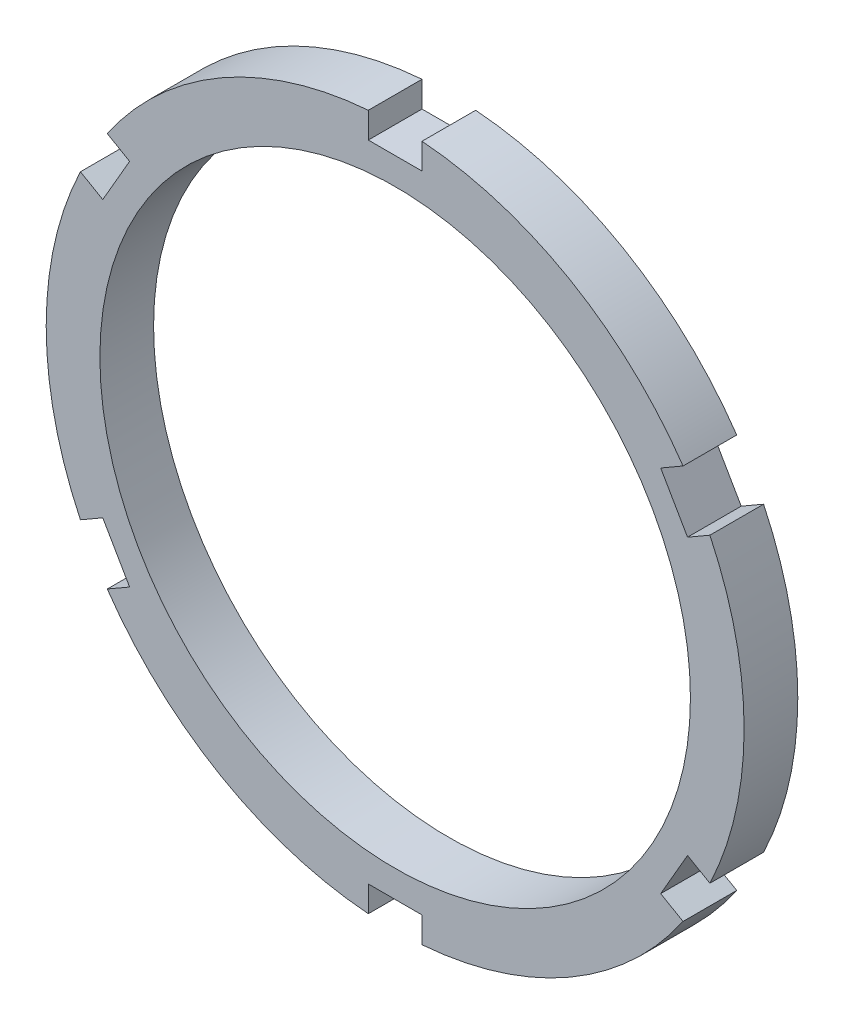
ISO-10303-21;
HEADER;
FILE_DESCRIPTION(('STEP AP214'),'2;1');
FILE_NAME('part.step','',(''),(''),'','','');
FILE_SCHEMA(('AUTOMOTIVE_DESIGN { 1 0 10303 214 1 1 1 1 }'));
ENDSEC;
DATA;
#1=APPLICATION_CONTEXT('core data for automotive mechanical design processes');
#2=APPLICATION_PROTOCOL_DEFINITION('international standard','automotive_design',2000,#1);
#3=PRODUCT_CONTEXT('',#1,'mechanical');
#4=PRODUCT('Part','Part','',(#3));
#5=PRODUCT_RELATED_PRODUCT_CATEGORY('part','',(#4));
#6=PRODUCT_DEFINITION_FORMATION('','',#4);
#7=PRODUCT_DEFINITION_CONTEXT('part definition',#1,'design');
#8=PRODUCT_DEFINITION('design','',#6,#7);
#9=PRODUCT_DEFINITION_SHAPE('','',#8);
#10=(LENGTH_UNIT() NAMED_UNIT(*) SI_UNIT(.MILLI.,.METRE.));
#11=(NAMED_UNIT(*) PLANE_ANGLE_UNIT() SI_UNIT($,.RADIAN.));
#12=(NAMED_UNIT(*) SI_UNIT($,.STERADIAN.) SOLID_ANGLE_UNIT());
#13=UNCERTAINTY_MEASURE_WITH_UNIT(LENGTH_MEASURE(1.E-05),#10,'distance_accuracy_value','');
#14=(GEOMETRIC_REPRESENTATION_CONTEXT(3) GLOBAL_UNCERTAINTY_ASSIGNED_CONTEXT((#13)) GLOBAL_UNIT_ASSIGNED_CONTEXT((#10,
#11,#12)) REPRESENTATION_CONTEXT('',''));
#15=CARTESIAN_POINT('',(0.,0.,0.));
#16=DIRECTION('',(0.,0.,1.));
#17=DIRECTION('',(1.,0.,0.));
#18=AXIS2_PLACEMENT_3D('',#15,#16,#17);
#19=CARTESIAN_POINT('',(0.,0.,10.));
#20=DIRECTION('',(0.,0.,-1.));
#21=DIRECTION('',(-1.,0.,0.));
#22=AXIS2_PLACEMENT_3D('',#19,#20,#21);
#23=CYLINDRICAL_SURFACE('',#22,65.);
#24=CARTESIAN_POINT('',(0.,0.,10.));
#25=DIRECTION('',(0.,0.,1.));
#26=DIRECTION('',(1.,0.,0.));
#27=AXIS2_PLACEMENT_3D('',#24,#25,#26);
#28=CIRCLE('',#27,65.);
#29=CARTESIAN_POINT('',(-5.,64.8074069840786,10.));
#30=VERTEX_POINT('',#29);
#31=CARTESIAN_POINT('',(-53.6248608016112,36.7338305109585,10.));
#32=VERTEX_POINT('',#31);
#33=EDGE_CURVE('E306',#30,#32,#28,.T.);
#34=ORIENTED_EDGE('',*,*,#33,.F.);
#35=DIRECTION('',(0.,0.,-1.));
#36=VECTOR('',#35,1.);
#37=CARTESIAN_POINT('',(-5.,64.8074069840786,10.));
#38=LINE('',#37,#36);
#39=CARTESIAN_POINT('',(-5.,64.8074069840786,0.));
#40=VERTEX_POINT('',#39);
#41=EDGE_CURVE('E274',#30,#40,#38,.T.);
#42=ORIENTED_EDGE('',*,*,#41,.T.);
#43=CARTESIAN_POINT('',(0.,0.,0.));
#44=DIRECTION('',(0.,0.,1.));
#45=DIRECTION('',(1.,0.,0.));
#46=AXIS2_PLACEMENT_3D('',#43,#44,#45);
#47=CIRCLE('',#46,65.);
#48=CARTESIAN_POINT('',(-53.6248608016112,36.7338305109585,0.));
#49=VERTEX_POINT('',#48);
#50=EDGE_CURVE('E220',#40,#49,#47,.T.);
#51=ORIENTED_EDGE('',*,*,#50,.T.);
#52=DIRECTION('',(0.,0.,-1.));
#53=VECTOR('',#52,1.);
#54=CARTESIAN_POINT('',(-53.6248608016112,36.7338305109585,10.));
#55=LINE('',#54,#53);
#56=EDGE_CURVE('E271',#49,#32,#55,.F.);
#57=ORIENTED_EDGE('',*,*,#56,.T.);
#58=EDGE_LOOP('',(#34,#42,#51,#57));
#59=FACE_BOUND('',#58,.T.);
#60=ADVANCED_FACE('F37',(#59),#23,.T.);
#61=CARTESIAN_POINT('',(-58.6248608016107,28.0735764731139,10.));
#62=VERTEX_POINT('',#61);
#63=CARTESIAN_POINT('',(-58.6248608016042,-28.0735764731275,10.));
#64=VERTEX_POINT('',#63);
#65=EDGE_CURVE('E269',#62,#64,#28,.T.);
#66=ORIENTED_EDGE('',*,*,#65,.F.);
#67=DIRECTION('',(0.,0.,-1.));
#68=VECTOR('',#67,1.);
#69=CARTESIAN_POINT('',(-58.6248608016107,28.0735764731139,10.));
#70=LINE('',#69,#68);
#71=CARTESIAN_POINT('',(-58.6248608016107,28.0735764731139,0.));
#72=VERTEX_POINT('',#71);
#73=EDGE_CURVE('E260',#62,#72,#70,.T.);
#74=ORIENTED_EDGE('',*,*,#73,.T.);
#75=CARTESIAN_POINT('',(-58.6248608016042,-28.0735764731275,0.));
#76=VERTEX_POINT('',#75);
#77=EDGE_CURVE('E227',#72,#76,#47,.T.);
#78=ORIENTED_EDGE('',*,*,#77,.T.);
#79=DIRECTION('',(0.,0.,-1.));
#80=VECTOR('',#79,1.);
#81=CARTESIAN_POINT('',(-58.6248608016041,-28.0735764731275,10.));
#82=LINE('',#81,#80);
#83=EDGE_CURVE('E340',#76,#64,#82,.F.);
#84=ORIENTED_EDGE('',*,*,#83,.T.);
#85=EDGE_LOOP('',(#66,#74,#78,#84));
#86=FACE_BOUND('',#85,.T.);
#87=ADVANCED_FACE('F266',(#86),#23,.T.);
#88=CARTESIAN_POINT('',(-53.6248608016026,-36.733830510971,10.));
#89=VERTEX_POINT('',#88);
#90=CARTESIAN_POINT('',(-4.99999999998411,-64.8074069840798,10.));
#91=VERTEX_POINT('',#90);
#92=EDGE_CURVE('E309',#89,#91,#28,.T.);
#93=ORIENTED_EDGE('',*,*,#92,.F.);
#94=DIRECTION('',(0.,0.,-1.));
#95=VECTOR('',#94,1.);
#96=CARTESIAN_POINT('',(-53.6248608016026,-36.733830510971,10.));
#97=LINE('',#96,#95);
#98=CARTESIAN_POINT('',(-53.6248608016026,-36.733830510971,0.));
#99=VERTEX_POINT('',#98);
#100=EDGE_CURVE('E276',#89,#99,#97,.T.);
#101=ORIENTED_EDGE('',*,*,#100,.T.);
#102=CARTESIAN_POINT('',(-4.99999999998411,-64.8074069840798,0.));
#103=VERTEX_POINT('',#102);
#104=EDGE_CURVE('E233',#99,#103,#47,.T.);
#105=ORIENTED_EDGE('',*,*,#104,.T.);
#106=DIRECTION('',(0.,0.,-1.));
#107=VECTOR('',#106,1.);
#108=CARTESIAN_POINT('',(-4.99999999998411,-64.8074069840798,10.));
#109=LINE('',#108,#107);
#110=EDGE_CURVE('E426',#103,#91,#109,.F.);
#111=ORIENTED_EDGE('',*,*,#110,.T.);
#112=EDGE_LOOP('',(#93,#101,#105,#111));
#113=FACE_BOUND('',#112,.T.);
#114=ADVANCED_FACE('F303',(#113),#23,.T.);
#115=CARTESIAN_POINT('',(53.6248608016066,36.7338305109651,0.));
#116=VERTEX_POINT('',#115);
#117=CARTESIAN_POINT('',(5.,64.8074069840786,0.));
#118=VERTEX_POINT('',#117);
#119=EDGE_CURVE('E226',#116,#118,#47,.T.);
#120=ORIENTED_EDGE('',*,*,#119,.T.);
#121=DIRECTION('',(0.,0.,-1.));
#122=VECTOR('',#121,1.);
#123=CARTESIAN_POINT('',(5.,64.8074069840786,10.));
#124=LINE('',#123,#122);
#125=CARTESIAN_POINT('',(5.,64.8074069840786,10.));
#126=VERTEX_POINT('',#125);
#127=EDGE_CURVE('E270',#118,#126,#124,.F.);
#128=ORIENTED_EDGE('',*,*,#127,.T.);
#129=CARTESIAN_POINT('',(53.6248608016066,36.7338305109651,10.));
#130=VERTEX_POINT('',#129);
#131=EDGE_CURVE('E244',#130,#126,#28,.T.);
#132=ORIENTED_EDGE('',*,*,#131,.F.);
#133=DIRECTION('',(0.,0.,-1.));
#134=VECTOR('',#133,1.);
#135=CARTESIAN_POINT('',(53.6248608016066,36.7338305109651,10.));
#136=LINE('',#135,#134);
#137=EDGE_CURVE('E337',#130,#116,#136,.T.);
#138=ORIENTED_EDGE('',*,*,#137,.T.);
#139=EDGE_LOOP('',(#120,#128,#132,#138));
#140=FACE_BOUND('',#139,.T.);
#141=ADVANCED_FACE('F637',(#140),#23,.T.);
#142=CARTESIAN_POINT('',(58.6248608016145,-28.0735764731059,0.));
#143=VERTEX_POINT('',#142);
#144=CARTESIAN_POINT('',(58.6248608016072,28.0735764731211,0.));
#145=VERTEX_POINT('',#144);
#146=EDGE_CURVE('E231',#143,#145,#47,.T.);
#147=ORIENTED_EDGE('',*,*,#146,.T.);
#148=DIRECTION('',(0.,0.,-1.));
#149=VECTOR('',#148,1.);
#150=CARTESIAN_POINT('',(58.6248608016072,28.0735764731211,10.));
#151=LINE('',#150,#149);
#152=CARTESIAN_POINT('',(58.6248608016072,28.0735764731211,10.));
#153=VERTEX_POINT('',#152);
#154=EDGE_CURVE('E333',#145,#153,#151,.F.);
#155=ORIENTED_EDGE('',*,*,#154,.T.);
#156=CARTESIAN_POINT('',(58.6248608016145,-28.0735764731059,10.));
#157=VERTEX_POINT('',#156);
#158=EDGE_CURVE('E230',#157,#153,#28,.T.);
#159=ORIENTED_EDGE('',*,*,#158,.F.);
#160=DIRECTION('',(0.,0.,-1.));
#161=VECTOR('',#160,1.);
#162=CARTESIAN_POINT('',(58.6248608016145,-28.0735764731059,10.));
#163=LINE('',#162,#161);
#164=EDGE_CURVE('E331',#157,#143,#163,.T.);
#165=ORIENTED_EDGE('',*,*,#164,.T.);
#166=EDGE_LOOP('',(#147,#155,#159,#165));
#167=FACE_BOUND('',#166,.T.);
#168=ADVANCED_FACE('F296',(#167),#23,.T.);
#169=CARTESIAN_POINT('',(5.00000000001589,-64.8074069840774,0.));
#170=VERTEX_POINT('',#169);
#171=CARTESIAN_POINT('',(53.6248608016161,-36.7338305109513,0.));
#172=VERTEX_POINT('',#171);
#173=EDGE_CURVE('E237',#170,#172,#47,.T.);
#174=ORIENTED_EDGE('',*,*,#173,.T.);
#175=DIRECTION('',(0.,0.,-1.));
#176=VECTOR('',#175,1.);
#177=CARTESIAN_POINT('',(53.6248608016161,-36.7338305109513,10.));
#178=LINE('',#177,#176);
#179=CARTESIAN_POINT('',(53.6248608016161,-36.7338305109513,10.));
#180=VERTEX_POINT('',#179);
#181=EDGE_CURVE('E60',#172,#180,#178,.F.);
#182=ORIENTED_EDGE('',*,*,#181,.T.);
#183=CARTESIAN_POINT('',(5.00000000001589,-64.8074069840774,10.));
#184=VERTEX_POINT('',#183);
#185=EDGE_CURVE('E312',#184,#180,#28,.T.);
#186=ORIENTED_EDGE('',*,*,#185,.F.);
#187=DIRECTION('',(0.,0.,-1.));
#188=VECTOR('',#187,1.);
#189=CARTESIAN_POINT('',(5.00000000001589,-64.8074069840774,10.));
#190=LINE('',#189,#188);
#191=EDGE_CURVE('E359',#184,#170,#190,.T.);
#192=ORIENTED_EDGE('',*,*,#191,.T.);
#193=EDGE_LOOP('',(#174,#182,#186,#192));
#194=FACE_BOUND('',#193,.T.);
#195=ADVANCED_FACE('F39',(#194),#23,.T.);
#196=CARTESIAN_POINT('',(0.,0.,10.));
#197=DIRECTION('',(0.,0.,1.));
#198=DIRECTION('',(1.,0.,0.));
#199=AXIS2_PLACEMENT_3D('',#196,#197,#198);
#200=PLANE('',#199);
#201=DIRECTION('',(0.,-1.,0.));
#202=VECTOR('',#201,1.);
#203=CARTESIAN_POINT('',(-5.,60.,10.));
#204=LINE('',#203,#202);
#205=CARTESIAN_POINT('',(-5.,60.,10.));
#206=VERTEX_POINT('',#205);
#207=EDGE_CURVE('E203',#30,#206,#204,.T.);
#208=ORIENTED_EDGE('',*,*,#207,.F.);
#209=ORIENTED_EDGE('',*,*,#33,.T.);
#210=DIRECTION('',(-0.866025403784438,0.5,0.));
#211=VECTOR('',#210,1.);
#212=CARTESIAN_POINT('',(-49.4615242270619,34.3301270189155,10.));
#213=LINE('',#212,#211);
#214=CARTESIAN_POINT('',(-49.4615242270619,34.3301270189155,10.));
#215=VERTEX_POINT('',#214);
#216=EDGE_CURVE('E439',#215,#32,#213,.T.);
#217=ORIENTED_EDGE('',*,*,#216,.F.);
#218=DIRECTION('',(0.499999999999999,0.866025403784439,0.));
#219=VECTOR('',#218,1.);
#220=CARTESIAN_POINT('',(-54.4615242270619,25.6698729810711,10.));
#221=LINE('',#220,#219);
#222=CARTESIAN_POINT('',(-54.4615242270619,25.6698729810711,10.));
#223=VERTEX_POINT('',#222);
#224=EDGE_CURVE('E436',#223,#215,#221,.T.);
#225=ORIENTED_EDGE('',*,*,#224,.F.);
#226=DIRECTION('',(0.866025403784439,-0.5,0.));
#227=VECTOR('',#226,1.);
#228=CARTESIAN_POINT('',(-54.4615242270619,25.6698729810711,10.));
#229=LINE('',#228,#227);
#230=EDGE_CURVE('E433',#62,#223,#229,.T.);
#231=ORIENTED_EDGE('',*,*,#230,.F.);
#232=ORIENTED_EDGE('',*,*,#65,.T.);
#233=DIRECTION('',(-0.866025403784438,-0.500000000000001,0.));
#234=VECTOR('',#233,1.);
#235=CARTESIAN_POINT('',(-54.461524227054,-25.669872981084,10.));
#236=LINE('',#235,#234);
#237=CARTESIAN_POINT('',(-54.461524227054,-25.669872981084,10.));
#238=VERTEX_POINT('',#237);
#239=EDGE_CURVE('E404',#238,#64,#236,.T.);
#240=ORIENTED_EDGE('',*,*,#239,.F.);
#241=DIRECTION('',(-0.5,0.866025403784439,0.));
#242=VECTOR('',#241,1.);
#243=CARTESIAN_POINT('',(-49.461524227054,-34.3301270189283,10.));
#244=LINE('',#243,#242);
#245=CARTESIAN_POINT('',(-49.461524227054,-34.3301270189283,10.));
#246=VERTEX_POINT('',#245);
#247=EDGE_CURVE('E401',#246,#238,#244,.T.);
#248=ORIENTED_EDGE('',*,*,#247,.F.);
#249=DIRECTION('',(0.866025403784438,0.5,0.));
#250=VECTOR('',#249,1.);
#251=CARTESIAN_POINT('',(-49.461524227054,-34.3301270189283,10.));
#252=LINE('',#251,#250);
#253=EDGE_CURVE('E398',#89,#246,#252,.T.);
#254=ORIENTED_EDGE('',*,*,#253,.F.);
#255=ORIENTED_EDGE('',*,*,#92,.T.);
#256=DIRECTION('',(0.,-1.,0.));
#257=VECTOR('',#256,1.);
#258=CARTESIAN_POINT('',(-4.99999999998411,-59.999999999999,10.));
#259=LINE('',#258,#257);
#260=CARTESIAN_POINT('',(-4.99999999998411,-59.999999999999,10.));
#261=VERTEX_POINT('',#260);
#262=EDGE_CURVE('E389',#261,#91,#259,.T.);
#263=ORIENTED_EDGE('',*,*,#262,.F.);
#264=DIRECTION('',(-1.,0.,0.));
#265=VECTOR('',#264,1.);
#266=CARTESIAN_POINT('',(5.00000000001589,-59.999999999999,10.));
#267=LINE('',#266,#265);
#268=CARTESIAN_POINT('',(5.00000000001589,-59.999999999999,10.));
#269=VERTEX_POINT('',#268);
#270=EDGE_CURVE('E386',#269,#261,#267,.T.);
#271=ORIENTED_EDGE('',*,*,#270,.F.);
#272=DIRECTION('',(0.,1.,0.));
#273=VECTOR('',#272,1.);
#274=CARTESIAN_POINT('',(5.00000000001589,-59.999999999999,10.));
#275=LINE('',#274,#273);
#276=EDGE_CURVE('E383',#184,#269,#275,.T.);
#277=ORIENTED_EDGE('',*,*,#276,.F.);
#278=ORIENTED_EDGE('',*,*,#185,.T.);
#279=DIRECTION('',(0.866025403784438,-0.5,0.));
#280=VECTOR('',#279,1.);
#281=CARTESIAN_POINT('',(49.4615242270778,-34.3301270189146,10.));
#282=LINE('',#281,#280);
#283=CARTESIAN_POINT('',(49.4615242270778,-34.3301270189146,10.));
#284=VERTEX_POINT('',#283);
#285=EDGE_CURVE('E374',#284,#180,#282,.T.);
#286=ORIENTED_EDGE('',*,*,#285,.F.);
#287=DIRECTION('',(-0.5,-0.866025403784439,0.));
#288=VECTOR('',#287,1.);
#289=CARTESIAN_POINT('',(54.4615242270778,-25.6698729810702,10.));
#290=LINE('',#289,#288);
#291=CARTESIAN_POINT('',(54.4615242270778,-25.6698729810702,10.));
#292=VERTEX_POINT('',#291);
#293=EDGE_CURVE('E371',#292,#284,#290,.T.);
#294=ORIENTED_EDGE('',*,*,#293,.F.);
#295=DIRECTION('',(-0.866025403784439,0.5,0.));
#296=VECTOR('',#295,1.);
#297=CARTESIAN_POINT('',(54.4615242270778,-25.6698729810702,10.));
#298=LINE('',#297,#296);
#299=EDGE_CURVE('E327',#157,#292,#298,.T.);
#300=ORIENTED_EDGE('',*,*,#299,.F.);
#301=ORIENTED_EDGE('',*,*,#158,.T.);
#302=DIRECTION('',(0.866025403784439,0.5,0.));
#303=VECTOR('',#302,1.);
#304=CARTESIAN_POINT('',(54.4615242270699,25.6698729810849,10.));
#305=LINE('',#304,#303);
#306=CARTESIAN_POINT('',(54.4615242270699,25.6698729810849,10.));
#307=VERTEX_POINT('',#306);
#308=EDGE_CURVE('E325',#307,#153,#305,.T.);
#309=ORIENTED_EDGE('',*,*,#308,.F.);
#310=DIRECTION('',(0.5,-0.866025403784438,0.));
#311=VECTOR('',#310,1.);
#312=CARTESIAN_POINT('',(49.4615242270699,34.3301270189293,10.));
#313=LINE('',#312,#311);
#314=CARTESIAN_POINT('',(49.4615242270699,34.3301270189293,10.));
#315=VERTEX_POINT('',#314);
#316=EDGE_CURVE('E379',#315,#307,#313,.T.);
#317=ORIENTED_EDGE('',*,*,#316,.F.);
#318=DIRECTION('',(-0.866025403784439,-0.5,0.));
#319=VECTOR('',#318,1.);
#320=CARTESIAN_POINT('',(49.4615242270699,34.3301270189293,10.));
#321=LINE('',#320,#319);
#322=EDGE_CURVE('E416',#130,#315,#321,.T.);
#323=ORIENTED_EDGE('',*,*,#322,.F.);
#324=ORIENTED_EDGE('',*,*,#131,.T.);
#325=DIRECTION('',(0.,1.,0.));
#326=VECTOR('',#325,1.);
#327=CARTESIAN_POINT('',(5.,60.,10.));
#328=LINE('',#327,#326);
#329=CARTESIAN_POINT('',(5.,60.,10.));
#330=VERTEX_POINT('',#329);
#331=EDGE_CURVE('E213',#330,#126,#328,.T.);
#332=ORIENTED_EDGE('',*,*,#331,.F.);
#333=DIRECTION('',(1.,0.,0.));
#334=VECTOR('',#333,1.);
#335=CARTESIAN_POINT('',(-5.,60.,10.));
#336=LINE('',#335,#334);
#337=EDGE_CURVE('E675',#206,#330,#336,.T.);
#338=ORIENTED_EDGE('',*,*,#337,.F.);
#339=EDGE_LOOP('',(#208,#209,#217,#225,#231,#232,#240,#248,#254,#255,#263,#271,#277,#278,#286,
#294,#300,#301,#309,#317,#323,#324,#332,#338));
#340=FACE_BOUND('',#339,.T.);
#341=CARTESIAN_POINT('',(0.,0.,10.));
#342=DIRECTION('',(0.,0.,1.));
#343=DIRECTION('',(1.,0.,0.));
#344=AXIS2_PLACEMENT_3D('',#341,#342,#343);
#345=CIRCLE('',#344,55.);
#346=CARTESIAN_POINT('',(55.,0.,10.));
#347=VERTEX_POINT('',#346);
#348=EDGE_CURVE('E281',#347,#347,#345,.T.);
#349=ORIENTED_EDGE('',*,*,#348,.F.);
#350=EDGE_LOOP('',(#349));
#351=FACE_BOUND('',#350,.T.);
#352=ADVANCED_FACE('F288',(#340,#351),#200,.T.);
#353=CARTESIAN_POINT('',(0.,0.,0.));
#354=DIRECTION('',(0.,0.,1.));
#355=DIRECTION('',(1.,0.,0.));
#356=AXIS2_PLACEMENT_3D('',#353,#354,#355);
#357=PLANE('',#356);
#358=ORIENTED_EDGE('',*,*,#50,.F.);
#359=DIRECTION('',(0.,-1.,0.));
#360=VECTOR('',#359,1.);
#361=CARTESIAN_POINT('',(-5.,0.,0.));
#362=LINE('',#361,#360);
#363=CARTESIAN_POINT('',(-5.,60.,0.));
#364=VERTEX_POINT('',#363);
#365=EDGE_CURVE('E11',#40,#364,#362,.T.);
#366=ORIENTED_EDGE('',*,*,#365,.T.);
#367=DIRECTION('',(1.,0.,0.));
#368=VECTOR('',#367,1.);
#369=CARTESIAN_POINT('',(-5.,60.,0.));
#370=LINE('',#369,#368);
#371=CARTESIAN_POINT('',(5.,60.,0.));
#372=VERTEX_POINT('',#371);
#373=EDGE_CURVE('E210',#364,#372,#370,.T.);
#374=ORIENTED_EDGE('',*,*,#373,.T.);
#375=DIRECTION('',(0.,1.,0.));
#376=VECTOR('',#375,1.);
#377=CARTESIAN_POINT('',(5.,60.,0.));
#378=LINE('',#377,#376);
#379=EDGE_CURVE('E52',#372,#118,#378,.T.);
#380=ORIENTED_EDGE('',*,*,#379,.T.);
#381=ORIENTED_EDGE('',*,*,#119,.F.);
#382=DIRECTION('',(-0.866025403784439,-0.5,0.));
#383=VECTOR('',#382,1.);
#384=CARTESIAN_POINT('',(-2.50000000000221,4.33012701892603,0.));
#385=LINE('',#384,#383);
#386=CARTESIAN_POINT('',(49.4615242270699,34.3301270189293,0.));
#387=VERTEX_POINT('',#386);
#388=EDGE_CURVE('E247',#116,#387,#385,.T.);
#389=ORIENTED_EDGE('',*,*,#388,.T.);
#390=DIRECTION('',(0.5,-0.866025403784438,0.));
#391=VECTOR('',#390,1.);
#392=CARTESIAN_POINT('',(49.4615242270699,34.3301270189293,0.));
#393=LINE('',#392,#391);
#394=CARTESIAN_POINT('',(54.4615242270699,25.6698729810849,0.));
#395=VERTEX_POINT('',#394);
#396=EDGE_CURVE('E412',#387,#395,#393,.T.);
#397=ORIENTED_EDGE('',*,*,#396,.T.);
#398=DIRECTION('',(0.866025403784439,0.5,0.));
#399=VECTOR('',#398,1.);
#400=CARTESIAN_POINT('',(54.4615242270699,25.6698729810849,0.));
#401=LINE('',#400,#399);
#402=EDGE_CURVE('E415',#395,#145,#401,.T.);
#403=ORIENTED_EDGE('',*,*,#402,.T.);
#404=ORIENTED_EDGE('',*,*,#146,.F.);
#405=DIRECTION('',(-0.866025403784439,0.5,0.));
#406=VECTOR('',#405,1.);
#407=CARTESIAN_POINT('',(2.50000000000617,4.33012701893289,0.));
#408=LINE('',#407,#406);
#409=CARTESIAN_POINT('',(54.4615242270778,-25.6698729810702,0.));
#410=VERTEX_POINT('',#409);
#411=EDGE_CURVE('E243',#143,#410,#408,.T.);
#412=ORIENTED_EDGE('',*,*,#411,.T.);
#413=DIRECTION('',(-0.5,-0.866025403784439,0.));
#414=VECTOR('',#413,1.);
#415=CARTESIAN_POINT('',(54.4615242270778,-25.6698729810702,0.));
#416=LINE('',#415,#414);
#417=CARTESIAN_POINT('',(49.4615242270778,-34.3301270189146,0.));
#418=VERTEX_POINT('',#417);
#419=EDGE_CURVE('E363',#410,#418,#416,.T.);
#420=ORIENTED_EDGE('',*,*,#419,.T.);
#421=DIRECTION('',(0.866025403784438,-0.5,0.));
#422=VECTOR('',#421,1.);
#423=CARTESIAN_POINT('',(49.4615242270778,-34.3301270189146,0.));
#424=LINE('',#423,#422);
#425=EDGE_CURVE('E361',#418,#172,#424,.T.);
#426=ORIENTED_EDGE('',*,*,#425,.T.);
#427=ORIENTED_EDGE('',*,*,#173,.F.);
#428=DIRECTION('',(0.,1.,0.));
#429=VECTOR('',#428,1.);
#430=CARTESIAN_POINT('',(5.00000000001588,0.,0.));
#431=LINE('',#430,#429);
#432=CARTESIAN_POINT('',(5.00000000001589,-59.999999999999,0.));
#433=VERTEX_POINT('',#432);
#434=EDGE_CURVE('E240',#170,#433,#431,.T.);
#435=ORIENTED_EDGE('',*,*,#434,.T.);
#436=DIRECTION('',(-1.,0.,0.));
#437=VECTOR('',#436,1.);
#438=CARTESIAN_POINT('',(5.00000000001589,-59.999999999999,0.));
#439=LINE('',#438,#437);
#440=CARTESIAN_POINT('',(-4.99999999998411,-59.999999999999,0.));
#441=VERTEX_POINT('',#440);
#442=EDGE_CURVE('E381',#433,#441,#439,.T.);
#443=ORIENTED_EDGE('',*,*,#442,.T.);
#444=DIRECTION('',(0.,-1.,0.));
#445=VECTOR('',#444,1.);
#446=CARTESIAN_POINT('',(-4.99999999998411,-59.999999999999,0.));
#447=LINE('',#446,#445);
#448=EDGE_CURVE('E355',#441,#103,#447,.T.);
#449=ORIENTED_EDGE('',*,*,#448,.T.);
#450=ORIENTED_EDGE('',*,*,#104,.F.);
#451=DIRECTION('',(0.866025403784438,0.5,0.));
#452=VECTOR('',#451,1.);
#453=CARTESIAN_POINT('',(2.50000000000574,-4.33012701893214,0.));
#454=LINE('',#453,#452);
#455=CARTESIAN_POINT('',(-49.461524227054,-34.3301270189283,0.));
#456=VERTEX_POINT('',#455);
#457=EDGE_CURVE('E250',#99,#456,#454,.T.);
#458=ORIENTED_EDGE('',*,*,#457,.T.);
#459=DIRECTION('',(-0.5,0.866025403784439,0.));
#460=VECTOR('',#459,1.);
#461=CARTESIAN_POINT('',(-49.461524227054,-34.3301270189283,0.));
#462=LINE('',#461,#460);
#463=CARTESIAN_POINT('',(-54.461524227054,-25.669872981084,0.));
#464=VERTEX_POINT('',#463);
#465=EDGE_CURVE('E395',#456,#464,#462,.T.);
#466=ORIENTED_EDGE('',*,*,#465,.T.);
#467=DIRECTION('',(-0.866025403784438,-0.500000000000001,0.));
#468=VECTOR('',#467,1.);
#469=CARTESIAN_POINT('',(-54.461524227054,-25.669872981084,0.));
#470=LINE('',#469,#468);
#471=EDGE_CURVE('E397',#464,#76,#470,.T.);
#472=ORIENTED_EDGE('',*,*,#471,.T.);
#473=ORIENTED_EDGE('',*,*,#77,.F.);
#474=DIRECTION('',(0.866025403784439,-0.5,0.));
#475=VECTOR('',#474,1.);
#476=CARTESIAN_POINT('',(-2.50000000000178,-4.33012701892529,0.));
#477=LINE('',#476,#475);
#478=CARTESIAN_POINT('',(-54.4615242270619,25.6698729810711,0.));
#479=VERTEX_POINT('',#478);
#480=EDGE_CURVE('E45',#72,#479,#477,.T.);
#481=ORIENTED_EDGE('',*,*,#480,.T.);
#482=DIRECTION('',(0.499999999999999,0.866025403784439,0.));
#483=VECTOR('',#482,1.);
#484=CARTESIAN_POINT('',(-54.4615242270619,25.6698729810711,0.));
#485=LINE('',#484,#483);
#486=CARTESIAN_POINT('',(-49.4615242270619,34.3301270189155,0.));
#487=VERTEX_POINT('',#486);
#488=EDGE_CURVE('E255',#479,#487,#485,.T.);
#489=ORIENTED_EDGE('',*,*,#488,.T.);
#490=DIRECTION('',(-0.866025403784438,0.5,0.));
#491=VECTOR('',#490,1.);
#492=CARTESIAN_POINT('',(-49.4615242270619,34.3301270189155,0.));
#493=LINE('',#492,#491);
#494=EDGE_CURVE('E223',#487,#49,#493,.T.);
#495=ORIENTED_EDGE('',*,*,#494,.T.);
#496=EDGE_LOOP('',(#358,#366,#374,#380,#381,#389,#397,#403,#404,#412,#420,#426,#427,#435,#443,
#449,#450,#458,#466,#472,#473,#481,#489,#495));
#497=FACE_BOUND('',#496,.T.);
#498=CARTESIAN_POINT('',(0.,0.,0.));
#499=DIRECTION('',(0.,0.,1.));
#500=DIRECTION('',(1.,0.,0.));
#501=AXIS2_PLACEMENT_3D('',#498,#499,#500);
#502=CIRCLE('',#501,55.);
#503=CARTESIAN_POINT('',(55.,0.,0.));
#504=VERTEX_POINT('',#503);
#505=EDGE_CURVE('E238',#504,#504,#502,.T.);
#506=ORIENTED_EDGE('',*,*,#505,.T.);
#507=EDGE_LOOP('',(#506));
#508=FACE_BOUND('',#507,.T.);
#509=ADVANCED_FACE('F216',(#497,#508),#357,.F.);
#510=CARTESIAN_POINT('',(0.,0.,0.));
#511=DIRECTION('',(0.,0.,1.));
#512=DIRECTION('',(1.,0.,0.));
#513=AXIS2_PLACEMENT_3D('',#510,#511,#512);
#514=CYLINDRICAL_SURFACE('',#513,55.);
#515=ORIENTED_EDGE('',*,*,#505,.F.);
#516=EDGE_LOOP('',(#515));
#517=FACE_BOUND('',#516,.T.);
#518=ORIENTED_EDGE('',*,*,#348,.T.);
#519=EDGE_LOOP('',(#518));
#520=FACE_BOUND('',#519,.T.);
#521=ADVANCED_FACE('F286',(#517,#520),#514,.F.);
#522=CARTESIAN_POINT('',(5.00000000001589,-59.999999999999,0.));
#523=DIRECTION('',(1.,0.,0.));
#524=DIRECTION('',(0.,1.,0.));
#525=AXIS2_PLACEMENT_3D('',#522,#523,#524);
#526=PLANE('',#525);
#527=ORIENTED_EDGE('',*,*,#276,.T.);
#528=DIRECTION('',(0.,0.,1.));
#529=VECTOR('',#528,1.);
#530=CARTESIAN_POINT('',(5.00000000001589,-59.999999999999,0.));
#531=LINE('',#530,#529);
#532=EDGE_CURVE('E375',#433,#269,#531,.T.);
#533=ORIENTED_EDGE('',*,*,#532,.F.);
#534=ORIENTED_EDGE('',*,*,#434,.F.);
#535=ORIENTED_EDGE('',*,*,#191,.F.);
#536=EDGE_LOOP('',(#527,#533,#534,#535));
#537=FACE_BOUND('',#536,.T.);
#538=ADVANCED_FACE('F471',(#537),#526,.F.);
#539=CARTESIAN_POINT('',(-4.99999999998411,-59.999999999999,0.));
#540=DIRECTION('',(-1.,0.,0.));
#541=DIRECTION('',(0.,-1.,0.));
#542=AXIS2_PLACEMENT_3D('',#539,#540,#541);
#543=PLANE('',#542);
#544=ORIENTED_EDGE('',*,*,#448,.F.);
#545=DIRECTION('',(0.,0.,1.));
#546=VECTOR('',#545,1.);
#547=CARTESIAN_POINT('',(-4.99999999998411,-59.999999999999,0.));
#548=LINE('',#547,#546);
#549=EDGE_CURVE('E385',#441,#261,#548,.T.);
#550=ORIENTED_EDGE('',*,*,#549,.T.);
#551=ORIENTED_EDGE('',*,*,#262,.T.);
#552=ORIENTED_EDGE('',*,*,#110,.F.);
#553=EDGE_LOOP('',(#544,#550,#551,#552));
#554=FACE_BOUND('',#553,.T.);
#555=ADVANCED_FACE('F474',(#554),#543,.F.);
#556=CARTESIAN_POINT('',(5.00000000001589,-59.999999999999,0.));
#557=DIRECTION('',(0.,1.,0.));
#558=DIRECTION('',(0.,0.,1.));
#559=AXIS2_PLACEMENT_3D('',#556,#557,#558);
#560=PLANE('',#559);
#561=ORIENTED_EDGE('',*,*,#270,.T.);
#562=ORIENTED_EDGE('',*,*,#549,.F.);
#563=ORIENTED_EDGE('',*,*,#442,.F.);
#564=ORIENTED_EDGE('',*,*,#532,.T.);
#565=EDGE_LOOP('',(#561,#562,#563,#564));
#566=FACE_BOUND('',#565,.T.);
#567=ADVANCED_FACE('F462',(#566),#560,.F.);
#568=CARTESIAN_POINT('',(54.4615242270778,-25.6698729810702,0.));
#569=DIRECTION('',(0.5,0.866025403784439,0.));
#570=DIRECTION('',(-0.866025403784439,0.5,0.));
#571=AXIS2_PLACEMENT_3D('',#568,#569,#570);
#572=PLANE('',#571);
#573=ORIENTED_EDGE('',*,*,#299,.T.);
#574=DIRECTION('',(0.,0.,1.));
#575=VECTOR('',#574,1.);
#576=CARTESIAN_POINT('',(54.4615242270778,-25.6698729810702,0.));
#577=LINE('',#576,#575);
#578=EDGE_CURVE('E366',#410,#292,#577,.T.);
#579=ORIENTED_EDGE('',*,*,#578,.F.);
#580=ORIENTED_EDGE('',*,*,#411,.F.);
#581=ORIENTED_EDGE('',*,*,#164,.F.);
#582=EDGE_LOOP('',(#573,#579,#580,#581));
#583=FACE_BOUND('',#582,.T.);
#584=ADVANCED_FACE('F458',(#583),#572,.F.);
#585=CARTESIAN_POINT('',(49.4615242270778,-34.3301270189146,0.));
#586=DIRECTION('',(-0.5,-0.866025403784438,0.));
#587=DIRECTION('',(0.866025403784438,-0.5,0.));
#588=AXIS2_PLACEMENT_3D('',#585,#586,#587);
#589=PLANE('',#588);
#590=ORIENTED_EDGE('',*,*,#425,.F.);
#591=DIRECTION('',(0.,0.,1.));
#592=VECTOR('',#591,1.);
#593=CARTESIAN_POINT('',(49.4615242270778,-34.3301270189146,0.));
#594=LINE('',#593,#592);
#595=EDGE_CURVE('E364',#418,#284,#594,.T.);
#596=ORIENTED_EDGE('',*,*,#595,.T.);
#597=ORIENTED_EDGE('',*,*,#285,.T.);
#598=ORIENTED_EDGE('',*,*,#181,.F.);
#599=EDGE_LOOP('',(#590,#596,#597,#598));
#600=FACE_BOUND('',#599,.T.);
#601=ADVANCED_FACE('F461',(#600),#589,.F.);
#602=CARTESIAN_POINT('',(54.4615242270778,-25.6698729810702,0.));
#603=DIRECTION('',(-0.866025403784439,0.5,0.));
#604=DIRECTION('',(-0.5,-0.866025403784439,0.));
#605=AXIS2_PLACEMENT_3D('',#602,#603,#604);
#606=PLANE('',#605);
#607=ORIENTED_EDGE('',*,*,#293,.T.);
#608=ORIENTED_EDGE('',*,*,#595,.F.);
#609=ORIENTED_EDGE('',*,*,#419,.F.);
#610=ORIENTED_EDGE('',*,*,#578,.T.);
#611=EDGE_LOOP('',(#607,#608,#609,#610));
#612=FACE_BOUND('',#611,.T.);
#613=ADVANCED_FACE('F466',(#612),#606,.F.);
#614=CARTESIAN_POINT('',(49.4615242270699,34.3301270189293,0.));
#615=DIRECTION('',(-0.5,0.866025403784439,0.));
#616=DIRECTION('',(-0.866025403784439,-0.5,0.));
#617=AXIS2_PLACEMENT_3D('',#614,#615,#616);
#618=PLANE('',#617);
#619=ORIENTED_EDGE('',*,*,#322,.T.);
#620=DIRECTION('',(0.,0.,1.));
#621=VECTOR('',#620,1.);
#622=CARTESIAN_POINT('',(49.4615242270699,34.3301270189293,0.));
#623=LINE('',#622,#621);
#624=EDGE_CURVE('E405',#387,#315,#623,.T.);
#625=ORIENTED_EDGE('',*,*,#624,.F.);
#626=ORIENTED_EDGE('',*,*,#388,.F.);
#627=ORIENTED_EDGE('',*,*,#137,.F.);
#628=EDGE_LOOP('',(#619,#625,#626,#627));
#629=FACE_BOUND('',#628,.T.);
#630=ADVANCED_FACE('F469',(#629),#618,.F.);
#631=CARTESIAN_POINT('',(54.4615242270699,25.6698729810849,0.));
#632=DIRECTION('',(0.5,-0.866025403784439,0.));
#633=DIRECTION('',(0.866025403784439,0.5,0.));
#634=AXIS2_PLACEMENT_3D('',#631,#632,#633);
#635=PLANE('',#634);
#636=ORIENTED_EDGE('',*,*,#402,.F.);
#637=DIRECTION('',(0.,0.,1.));
#638=VECTOR('',#637,1.);
#639=CARTESIAN_POINT('',(54.4615242270699,25.6698729810849,0.));
#640=LINE('',#639,#638);
#641=EDGE_CURVE('E418',#395,#307,#640,.T.);
#642=ORIENTED_EDGE('',*,*,#641,.T.);
#643=ORIENTED_EDGE('',*,*,#308,.T.);
#644=ORIENTED_EDGE('',*,*,#154,.F.);
#645=EDGE_LOOP('',(#636,#642,#643,#644));
#646=FACE_BOUND('',#645,.T.);
#647=ADVANCED_FACE('F496',(#646),#635,.F.);
#648=CARTESIAN_POINT('',(49.4615242270699,34.3301270189293,0.));
#649=DIRECTION('',(-0.866025403784438,-0.5,0.));
#650=DIRECTION('',(0.5,-0.866025403784438,0.));
#651=AXIS2_PLACEMENT_3D('',#648,#649,#650);
#652=PLANE('',#651);
#653=ORIENTED_EDGE('',*,*,#316,.T.);
#654=ORIENTED_EDGE('',*,*,#641,.F.);
#655=ORIENTED_EDGE('',*,*,#396,.F.);
#656=ORIENTED_EDGE('',*,*,#624,.T.);
#657=EDGE_LOOP('',(#653,#654,#655,#656));
#658=FACE_BOUND('',#657,.T.);
#659=ADVANCED_FACE('F486',(#658),#652,.F.);
#660=CARTESIAN_POINT('',(-49.461524227054,-34.3301270189283,0.));
#661=DIRECTION('',(0.5,-0.866025403784438,0.));
#662=DIRECTION('',(0.866025403784438,0.5,0.));
#663=AXIS2_PLACEMENT_3D('',#660,#661,#662);
#664=PLANE('',#663);
#665=ORIENTED_EDGE('',*,*,#253,.T.);
#666=DIRECTION('',(0.,0.,1.));
#667=VECTOR('',#666,1.);
#668=CARTESIAN_POINT('',(-49.461524227054,-34.3301270189283,0.));
#669=LINE('',#668,#667);
#670=EDGE_CURVE('E408',#456,#246,#669,.T.);
#671=ORIENTED_EDGE('',*,*,#670,.F.);
#672=ORIENTED_EDGE('',*,*,#457,.F.);
#673=ORIENTED_EDGE('',*,*,#100,.F.);
#674=EDGE_LOOP('',(#665,#671,#672,#673));
#675=FACE_BOUND('',#674,.T.);
#676=ADVANCED_FACE('F482',(#675),#664,.F.);
#677=CARTESIAN_POINT('',(-54.461524227054,-25.669872981084,0.));
#678=DIRECTION('',(-0.500000000000001,0.866025403784438,0.));
#679=DIRECTION('',(-0.866025403784438,-0.500000000000001,0.));
#680=AXIS2_PLACEMENT_3D('',#677,#678,#679);
#681=PLANE('',#680);
#682=ORIENTED_EDGE('',*,*,#471,.F.);
#683=DIRECTION('',(0.,0.,1.));
#684=VECTOR('',#683,1.);
#685=CARTESIAN_POINT('',(-54.461524227054,-25.669872981084,0.));
#686=LINE('',#685,#684);
#687=EDGE_CURVE('E400',#464,#238,#686,.T.);
#688=ORIENTED_EDGE('',*,*,#687,.T.);
#689=ORIENTED_EDGE('',*,*,#239,.T.);
#690=ORIENTED_EDGE('',*,*,#83,.F.);
#691=EDGE_LOOP('',(#682,#688,#689,#690));
#692=FACE_BOUND('',#691,.T.);
#693=ADVANCED_FACE('F485',(#692),#681,.F.);
#694=CARTESIAN_POINT('',(-49.461524227054,-34.3301270189283,0.));
#695=DIRECTION('',(0.866025403784439,0.5,0.));
#696=DIRECTION('',(-0.5,0.866025403784439,0.));
#697=AXIS2_PLACEMENT_3D('',#694,#695,#696);
#698=PLANE('',#697);
#699=ORIENTED_EDGE('',*,*,#247,.T.);
#700=ORIENTED_EDGE('',*,*,#687,.F.);
#701=ORIENTED_EDGE('',*,*,#465,.F.);
#702=ORIENTED_EDGE('',*,*,#670,.T.);
#703=EDGE_LOOP('',(#699,#700,#701,#702));
#704=FACE_BOUND('',#703,.T.);
#705=ADVANCED_FACE('F489',(#704),#698,.F.);
#706=CARTESIAN_POINT('',(-54.4615242270619,25.6698729810711,0.));
#707=DIRECTION('',(-0.5,-0.866025403784439,0.));
#708=DIRECTION('',(0.866025403784439,-0.5,0.));
#709=AXIS2_PLACEMENT_3D('',#706,#707,#708);
#710=PLANE('',#709);
#711=ORIENTED_EDGE('',*,*,#230,.T.);
#712=DIRECTION('',(0.,0.,1.));
#713=VECTOR('',#712,1.);
#714=CARTESIAN_POINT('',(-54.4615242270619,25.6698729810711,0.));
#715=LINE('',#714,#713);
#716=EDGE_CURVE('E263',#479,#223,#715,.T.);
#717=ORIENTED_EDGE('',*,*,#716,.F.);
#718=ORIENTED_EDGE('',*,*,#480,.F.);
#719=ORIENTED_EDGE('',*,*,#73,.F.);
#720=EDGE_LOOP('',(#711,#717,#718,#719));
#721=FACE_BOUND('',#720,.T.);
#722=ADVANCED_FACE('F259',(#721),#710,.F.);
#723=CARTESIAN_POINT('',(-49.4615242270619,34.3301270189155,0.));
#724=DIRECTION('',(0.5,0.866025403784438,0.));
#725=DIRECTION('',(-0.866025403784438,0.5,0.));
#726=AXIS2_PLACEMENT_3D('',#723,#724,#725);
#727=PLANE('',#726);
#728=ORIENTED_EDGE('',*,*,#494,.F.);
#729=DIRECTION('',(0.,0.,1.));
#730=VECTOR('',#729,1.);
#731=CARTESIAN_POINT('',(-49.4615242270619,34.3301270189155,0.));
#732=LINE('',#731,#730);
#733=EDGE_CURVE('E435',#487,#215,#732,.T.);
#734=ORIENTED_EDGE('',*,*,#733,.T.);
#735=ORIENTED_EDGE('',*,*,#216,.T.);
#736=ORIENTED_EDGE('',*,*,#56,.F.);
#737=EDGE_LOOP('',(#728,#734,#735,#736));
#738=FACE_BOUND('',#737,.T.);
#739=ADVANCED_FACE('F443',(#738),#727,.F.);
#740=CARTESIAN_POINT('',(-54.4615242270619,25.6698729810711,0.));
#741=DIRECTION('',(0.866025403784439,-0.499999999999999,0.));
#742=DIRECTION('',(0.499999999999999,0.866025403784439,0.));
#743=AXIS2_PLACEMENT_3D('',#740,#741,#742);
#744=PLANE('',#743);
#745=ORIENTED_EDGE('',*,*,#224,.T.);
#746=ORIENTED_EDGE('',*,*,#733,.F.);
#747=ORIENTED_EDGE('',*,*,#488,.F.);
#748=ORIENTED_EDGE('',*,*,#716,.T.);
#749=EDGE_LOOP('',(#745,#746,#747,#748));
#750=FACE_BOUND('',#749,.T.);
#751=ADVANCED_FACE('F446',(#750),#744,.F.);
#752=CARTESIAN_POINT('',(-5.,60.,0.));
#753=DIRECTION('',(-1.,0.,0.));
#754=DIRECTION('',(0.,0.,1.));
#755=AXIS2_PLACEMENT_3D('',#752,#753,#754);
#756=PLANE('',#755);
#757=ORIENTED_EDGE('',*,*,#207,.T.);
#758=DIRECTION('',(0.,0.,1.));
#759=VECTOR('',#758,1.);
#760=CARTESIAN_POINT('',(-5.,60.,0.));
#761=LINE('',#760,#759);
#762=EDGE_CURVE('E198',#364,#206,#761,.T.);
#763=ORIENTED_EDGE('',*,*,#762,.F.);
#764=ORIENTED_EDGE('',*,*,#365,.F.);
#765=ORIENTED_EDGE('',*,*,#41,.F.);
#766=EDGE_LOOP('',(#757,#763,#764,#765));
#767=FACE_BOUND('',#766,.T.);
#768=ADVANCED_FACE('F200',(#767),#756,.F.);
#769=CARTESIAN_POINT('',(5.,60.,0.));
#770=DIRECTION('',(1.,0.,0.));
#771=DIRECTION('',(0.,0.,-1.));
#772=AXIS2_PLACEMENT_3D('',#769,#770,#771);
#773=PLANE('',#772);
#774=ORIENTED_EDGE('',*,*,#379,.F.);
#775=DIRECTION('',(0.,0.,1.));
#776=VECTOR('',#775,1.);
#777=CARTESIAN_POINT('',(5.,60.,0.));
#778=LINE('',#777,#776);
#779=EDGE_CURVE('E207',#372,#330,#778,.T.);
#780=ORIENTED_EDGE('',*,*,#779,.T.);
#781=ORIENTED_EDGE('',*,*,#331,.T.);
#782=ORIENTED_EDGE('',*,*,#127,.F.);
#783=EDGE_LOOP('',(#774,#780,#781,#782));
#784=FACE_BOUND('',#783,.T.);
#785=ADVANCED_FACE('F453',(#784),#773,.F.);
#786=CARTESIAN_POINT('',(-5.,60.,0.));
#787=DIRECTION('',(0.,-1.,0.));
#788=DIRECTION('',(0.,0.,-1.));
#789=AXIS2_PLACEMENT_3D('',#786,#787,#788);
#790=PLANE('',#789);
#791=ORIENTED_EDGE('',*,*,#337,.T.);
#792=ORIENTED_EDGE('',*,*,#779,.F.);
#793=ORIENTED_EDGE('',*,*,#373,.F.);
#794=ORIENTED_EDGE('',*,*,#762,.T.);
#795=EDGE_LOOP('',(#791,#792,#793,#794));
#796=FACE_BOUND('',#795,.T.);
#797=ADVANCED_FACE('F211',(#796),#790,.F.);
#798=CLOSED_SHELL('',(#60,#87,#114,#141,#168,#195,#352,#509,#521,#538,#555,#567,#584,#601,#613,
#630,#647,#659,#676,#693,#705,#722,#739,#751,#768,#785,#797));
#799=MANIFOLD_SOLID_BREP('B2',#798);
#800=ADVANCED_BREP_SHAPE_REPRESENTATION('',(#18,#799),#14);
#801=SHAPE_DEFINITION_REPRESENTATION(#9,#800);
ENDSEC;
END-ISO-10303-21;
